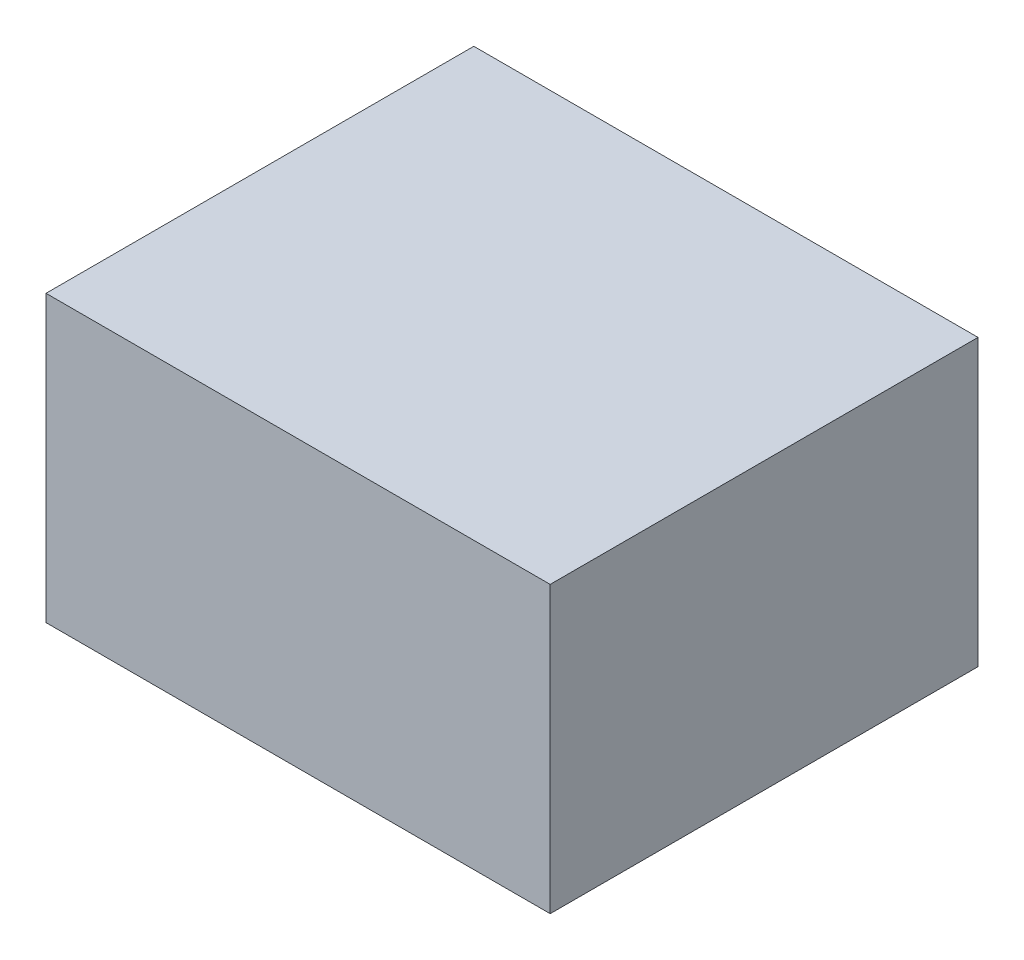
ISO-10303-21;
HEADER;
FILE_DESCRIPTION(('STEP AP214'),'2;1');
FILE_NAME('part.step','',(''),(''),'','','');
FILE_SCHEMA(('AUTOMOTIVE_DESIGN { 1 0 10303 214 1 1 1 1 }'));
ENDSEC;
DATA;
#1=APPLICATION_CONTEXT('core data for automotive mechanical design processes');
#2=APPLICATION_PROTOCOL_DEFINITION('international standard','automotive_design',2000,#1);
#3=PRODUCT_CONTEXT('',#1,'mechanical');
#4=PRODUCT('Part','Part','',(#3));
#5=PRODUCT_RELATED_PRODUCT_CATEGORY('part','',(#4));
#6=PRODUCT_DEFINITION_FORMATION('','',#4);
#7=PRODUCT_DEFINITION_CONTEXT('part definition',#1,'design');
#8=PRODUCT_DEFINITION('design','',#6,#7);
#9=PRODUCT_DEFINITION_SHAPE('','',#8);
#10=(LENGTH_UNIT() NAMED_UNIT(*) SI_UNIT(.MILLI.,.METRE.));
#11=(NAMED_UNIT(*) PLANE_ANGLE_UNIT() SI_UNIT($,.RADIAN.));
#12=(NAMED_UNIT(*) SI_UNIT($,.STERADIAN.) SOLID_ANGLE_UNIT());
#13=UNCERTAINTY_MEASURE_WITH_UNIT(LENGTH_MEASURE(1.E-05),#10,'distance_accuracy_value','');
#14=(GEOMETRIC_REPRESENTATION_CONTEXT(3) GLOBAL_UNCERTAINTY_ASSIGNED_CONTEXT((#13)) GLOBAL_UNIT_ASSIGNED_CONTEXT((#10,
#11,#12)) REPRESENTATION_CONTEXT('',''));
#15=CARTESIAN_POINT('',(0.,0.,0.));
#16=DIRECTION('',(0.,0.,1.));
#17=DIRECTION('',(1.,0.,0.));
#18=AXIS2_PLACEMENT_3D('',#15,#16,#17);
#19=CARTESIAN_POINT('',(0.,0.,4.65));
#20=DIRECTION('',(0.,0.,1.));
#21=DIRECTION('',(1.,0.,0.));
#22=AXIS2_PLACEMENT_3D('',#19,#20,#21);
#23=PLANE('',#22);
#24=DIRECTION('',(1.,0.,0.));
#25=VECTOR('',#24,1.);
#26=CARTESIAN_POINT('',(-2.74,-1.55,4.65));
#27=LINE('',#26,#25);
#28=CARTESIAN_POINT('',(-2.74,-1.55,4.65));
#29=VERTEX_POINT('',#28);
#30=CARTESIAN_POINT('',(2.74,-1.55,4.65));
#31=VERTEX_POINT('',#30);
#32=EDGE_CURVE('E93',#29,#31,#27,.T.);
#33=ORIENTED_EDGE('',*,*,#32,.T.);
#34=DIRECTION('',(0.,1.,0.));
#35=VECTOR('',#34,1.);
#36=CARTESIAN_POINT('',(2.74,-1.55,4.65));
#37=LINE('',#36,#35);
#38=CARTESIAN_POINT('',(2.74,1.55,4.65));
#39=VERTEX_POINT('',#38);
#40=EDGE_CURVE('E69',#31,#39,#37,.T.);
#41=ORIENTED_EDGE('',*,*,#40,.T.);
#42=DIRECTION('',(-1.,0.,0.));
#43=VECTOR('',#42,1.);
#44=CARTESIAN_POINT('',(2.74,1.55,4.65));
#45=LINE('',#44,#43);
#46=CARTESIAN_POINT('',(-2.74,1.55,4.65));
#47=VERTEX_POINT('',#46);
#48=EDGE_CURVE('E86',#39,#47,#45,.T.);
#49=ORIENTED_EDGE('',*,*,#48,.T.);
#50=DIRECTION('',(0.,-1.,0.));
#51=VECTOR('',#50,1.);
#52=CARTESIAN_POINT('',(-2.74,1.55,4.65));
#53=LINE('',#52,#51);
#54=EDGE_CURVE('E11',#47,#29,#53,.T.);
#55=ORIENTED_EDGE('',*,*,#54,.T.);
#56=EDGE_LOOP('',(#33,#41,#49,#55));
#57=FACE_BOUND('',#56,.T.);
#58=ADVANCED_FACE('F17',(#57),#23,.T.);
#59=CARTESIAN_POINT('',(0.,0.,0.));
#60=DIRECTION('',(0.,0.,1.));
#61=DIRECTION('',(1.,0.,0.));
#62=AXIS2_PLACEMENT_3D('',#59,#60,#61);
#63=PLANE('',#62);
#64=DIRECTION('',(0.,-1.,0.));
#65=VECTOR('',#64,1.);
#66=CARTESIAN_POINT('',(-2.74,1.55,0.));
#67=LINE('',#66,#65);
#68=CARTESIAN_POINT('',(-2.74,1.55,0.));
#69=VERTEX_POINT('',#68);
#70=CARTESIAN_POINT('',(-2.74,-1.55,0.));
#71=VERTEX_POINT('',#70);
#72=EDGE_CURVE('E26',#69,#71,#67,.T.);
#73=ORIENTED_EDGE('',*,*,#72,.F.);
#74=DIRECTION('',(-1.,0.,0.));
#75=VECTOR('',#74,1.);
#76=CARTESIAN_POINT('',(2.74,1.55,0.));
#77=LINE('',#76,#75);
#78=CARTESIAN_POINT('',(2.74,1.55,0.));
#79=VERTEX_POINT('',#78);
#80=EDGE_CURVE('E107',#79,#69,#77,.T.);
#81=ORIENTED_EDGE('',*,*,#80,.F.);
#82=DIRECTION('',(0.,1.,0.));
#83=VECTOR('',#82,1.);
#84=CARTESIAN_POINT('',(2.74,-1.55,0.));
#85=LINE('',#84,#83);
#86=CARTESIAN_POINT('',(2.74,-1.55,0.));
#87=VERTEX_POINT('',#86);
#88=EDGE_CURVE('E75',#87,#79,#85,.T.);
#89=ORIENTED_EDGE('',*,*,#88,.F.);
#90=DIRECTION('',(1.,0.,0.));
#91=VECTOR('',#90,1.);
#92=CARTESIAN_POINT('',(-2.74,-1.55,0.));
#93=LINE('',#92,#91);
#94=EDGE_CURVE('E92',#71,#87,#93,.T.);
#95=ORIENTED_EDGE('',*,*,#94,.F.);
#96=EDGE_LOOP('',(#73,#81,#89,#95));
#97=FACE_BOUND('',#96,.T.);
#98=ADVANCED_FACE('F19',(#97),#63,.F.);
#99=CARTESIAN_POINT('',(-2.74,1.55,0.));
#100=DIRECTION('',(1.,0.,0.));
#101=DIRECTION('',(0.,1.,0.));
#102=AXIS2_PLACEMENT_3D('',#99,#100,#101);
#103=PLANE('',#102);
#104=ORIENTED_EDGE('',*,*,#72,.T.);
#105=DIRECTION('',(0.,0.,1.));
#106=VECTOR('',#105,1.);
#107=CARTESIAN_POINT('',(-2.74,-1.55,0.));
#108=LINE('',#107,#106);
#109=EDGE_CURVE('E80',#71,#29,#108,.T.);
#110=ORIENTED_EDGE('',*,*,#109,.T.);
#111=ORIENTED_EDGE('',*,*,#54,.F.);
#112=DIRECTION('',(0.,0.,1.));
#113=VECTOR('',#112,1.);
#114=CARTESIAN_POINT('',(-2.74,1.55,0.));
#115=LINE('',#114,#113);
#116=EDGE_CURVE('E83',#69,#47,#115,.T.);
#117=ORIENTED_EDGE('',*,*,#116,.F.);
#118=EDGE_LOOP('',(#104,#110,#111,#117));
#119=FACE_BOUND('',#118,.T.);
#120=ADVANCED_FACE('F79',(#119),#103,.F.);
#121=CARTESIAN_POINT('',(2.74,1.55,0.));
#122=DIRECTION('',(0.,-1.,0.));
#123=DIRECTION('',(0.,0.,-1.));
#124=AXIS2_PLACEMENT_3D('',#121,#122,#123);
#125=PLANE('',#124);
#126=ORIENTED_EDGE('',*,*,#80,.T.);
#127=ORIENTED_EDGE('',*,*,#116,.T.);
#128=ORIENTED_EDGE('',*,*,#48,.F.);
#129=DIRECTION('',(0.,0.,1.));
#130=VECTOR('',#129,1.);
#131=CARTESIAN_POINT('',(2.74,1.55,0.));
#132=LINE('',#131,#130);
#133=EDGE_CURVE('E112',#79,#39,#132,.T.);
#134=ORIENTED_EDGE('',*,*,#133,.F.);
#135=EDGE_LOOP('',(#126,#127,#128,#134));
#136=FACE_BOUND('',#135,.T.);
#137=ADVANCED_FACE('F123',(#136),#125,.F.);
#138=CARTESIAN_POINT('',(2.74,-1.55,0.));
#139=DIRECTION('',(-1.,0.,0.));
#140=DIRECTION('',(0.,0.,1.));
#141=AXIS2_PLACEMENT_3D('',#138,#139,#140);
#142=PLANE('',#141);
#143=ORIENTED_EDGE('',*,*,#88,.T.);
#144=ORIENTED_EDGE('',*,*,#133,.T.);
#145=ORIENTED_EDGE('',*,*,#40,.F.);
#146=DIRECTION('',(0.,0.,1.));
#147=VECTOR('',#146,1.);
#148=CARTESIAN_POINT('',(2.74,-1.55,0.));
#149=LINE('',#148,#147);
#150=EDGE_CURVE('E97',#87,#31,#149,.T.);
#151=ORIENTED_EDGE('',*,*,#150,.F.);
#152=EDGE_LOOP('',(#143,#144,#145,#151));
#153=FACE_BOUND('',#152,.T.);
#154=ADVANCED_FACE('F124',(#153),#142,.F.);
#155=CARTESIAN_POINT('',(-2.74,-1.55,0.));
#156=DIRECTION('',(0.,1.,0.));
#157=DIRECTION('',(1.,0.,0.));
#158=AXIS2_PLACEMENT_3D('',#155,#156,#157);
#159=PLANE('',#158);
#160=ORIENTED_EDGE('',*,*,#94,.T.);
#161=ORIENTED_EDGE('',*,*,#150,.T.);
#162=ORIENTED_EDGE('',*,*,#32,.F.);
#163=ORIENTED_EDGE('',*,*,#109,.F.);
#164=EDGE_LOOP('',(#160,#161,#162,#163));
#165=FACE_BOUND('',#164,.T.);
#166=ADVANCED_FACE('F90',(#165),#159,.F.);
#167=CLOSED_SHELL('',(#58,#98,#120,#137,#154,#166));
#168=MANIFOLD_SOLID_BREP('B1',#167);
#169=ADVANCED_BREP_SHAPE_REPRESENTATION('',(#18,#168),#14);
#170=SHAPE_DEFINITION_REPRESENTATION(#9,#169);
ENDSEC;
END-ISO-10303-21;
